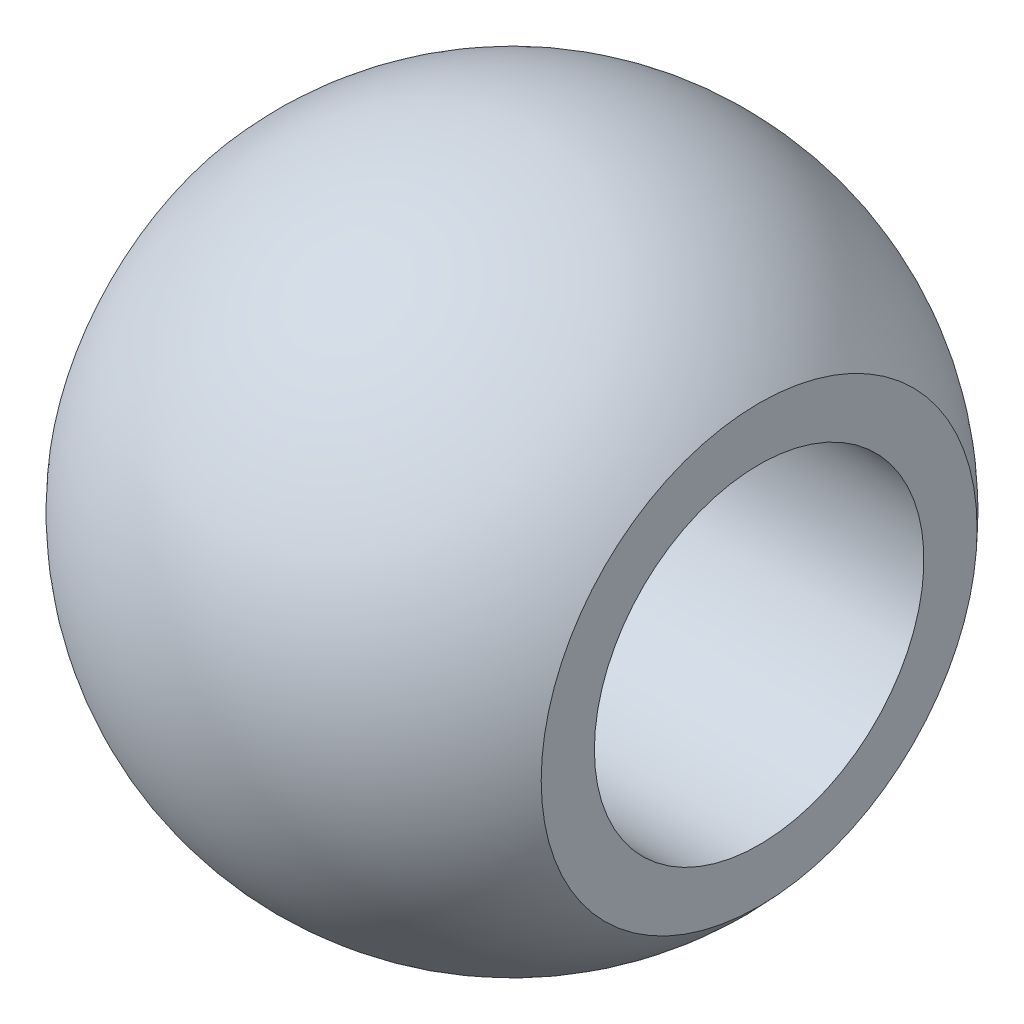
ISO-10303-21;
HEADER;
FILE_DESCRIPTION(('STEP AP214'),'2;1');
FILE_NAME('part.step','',(''),(''),'','','');
FILE_SCHEMA(('AUTOMOTIVE_DESIGN { 1 0 10303 214 1 1 1 1 }'));
ENDSEC;
DATA;
#1=APPLICATION_CONTEXT('core data for automotive mechanical design processes');
#2=APPLICATION_PROTOCOL_DEFINITION('international standard','automotive_design',2000,#1);
#3=PRODUCT_CONTEXT('',#1,'mechanical');
#4=PRODUCT('Part','Part','',(#3));
#5=PRODUCT_RELATED_PRODUCT_CATEGORY('part','',(#4));
#6=PRODUCT_DEFINITION_FORMATION('','',#4);
#7=PRODUCT_DEFINITION_CONTEXT('part definition',#1,'design');
#8=PRODUCT_DEFINITION('design','',#6,#7);
#9=PRODUCT_DEFINITION_SHAPE('','',#8);
#10=(LENGTH_UNIT() NAMED_UNIT(*) SI_UNIT(.MILLI.,.METRE.));
#11=(NAMED_UNIT(*) PLANE_ANGLE_UNIT() SI_UNIT($,.RADIAN.));
#12=(NAMED_UNIT(*) SI_UNIT($,.STERADIAN.) SOLID_ANGLE_UNIT());
#13=UNCERTAINTY_MEASURE_WITH_UNIT(LENGTH_MEASURE(1.E-05),#10,'distance_accuracy_value','');
#14=(GEOMETRIC_REPRESENTATION_CONTEXT(3) GLOBAL_UNCERTAINTY_ASSIGNED_CONTEXT((#13)) GLOBAL_UNIT_ASSIGNED_CONTEXT((#10,
#11,#12)) REPRESENTATION_CONTEXT('',''));
#15=CARTESIAN_POINT('',(0.,0.,0.));
#16=DIRECTION('',(0.,0.,1.));
#17=DIRECTION('',(1.,0.,0.));
#18=AXIS2_PLACEMENT_3D('',#15,#16,#17);
#19=CARTESIAN_POINT('',(-7.5,0.,0.));
#20=DIRECTION('',(1.,0.,0.));
#21=DIRECTION('',(0.,0.,-1.));
#22=AXIS2_PLACEMENT_3D('',#19,#20,#21);
#23=PLANE('',#22);
#24=CARTESIAN_POINT('',(-7.5,0.,0.));
#25=DIRECTION('',(1.,0.,0.));
#26=DIRECTION('',(0.,0.,-1.));
#27=AXIS2_PLACEMENT_3D('',#24,#25,#26);
#28=CIRCLE('',#27,5.);
#29=CARTESIAN_POINT('',(-7.5,0.,-5.));
#30=VERTEX_POINT('',#29);
#31=EDGE_CURVE('E51',#30,#30,#28,.T.);
#32=ORIENTED_EDGE('',*,*,#31,.T.);
#33=EDGE_LOOP('',(#32));
#34=FACE_BOUND('',#33,.T.);
#35=CARTESIAN_POINT('',(-7.5,0.,0.));
#36=DIRECTION('',(-1.,0.,0.));
#37=DIRECTION('',(0.,0.,1.));
#38=AXIS2_PLACEMENT_3D('',#35,#36,#37);
#39=CIRCLE('',#38,6.61437827766148);
#40=CARTESIAN_POINT('',(-7.5,0.,6.61437827766148));
#41=VERTEX_POINT('',#40);
#42=EDGE_CURVE('E46',#41,#41,#39,.T.);
#43=ORIENTED_EDGE('',*,*,#42,.T.);
#44=EDGE_LOOP('',(#43));
#45=FACE_BOUND('',#44,.T.);
#46=ADVANCED_FACE('F39',(#34,#45),#23,.F.);
#47=CARTESIAN_POINT('',(7.5,0.,0.));
#48=DIRECTION('',(-1.,0.,0.));
#49=DIRECTION('',(0.,0.,1.));
#50=AXIS2_PLACEMENT_3D('',#47,#48,#49);
#51=PLANE('',#50);
#52=CARTESIAN_POINT('',(7.5,0.,0.));
#53=DIRECTION('',(-1.,0.,0.));
#54=DIRECTION('',(0.,0.,1.));
#55=AXIS2_PLACEMENT_3D('',#52,#53,#54);
#56=CIRCLE('',#55,5.);
#57=CARTESIAN_POINT('',(7.5,0.,5.));
#58=VERTEX_POINT('',#57);
#59=EDGE_CURVE('E56',#58,#58,#56,.T.);
#60=ORIENTED_EDGE('',*,*,#59,.T.);
#61=EDGE_LOOP('',(#60));
#62=FACE_BOUND('',#61,.T.);
#63=CARTESIAN_POINT('',(7.5,0.,0.));
#64=DIRECTION('',(-1.,0.,0.));
#65=DIRECTION('',(0.,0.,1.));
#66=AXIS2_PLACEMENT_3D('',#63,#64,#65);
#67=CIRCLE('',#66,6.61437827766149);
#68=CARTESIAN_POINT('',(7.5,0.,6.61437827766149));
#69=VERTEX_POINT('',#68);
#70=EDGE_CURVE('E10',#69,#69,#67,.T.);
#71=ORIENTED_EDGE('',*,*,#70,.F.);
#72=EDGE_LOOP('',(#71));
#73=FACE_BOUND('',#72,.T.);
#74=ADVANCED_FACE('F63',(#62,#73),#51,.F.);
#75=CARTESIAN_POINT('',(0.,0.,0.));
#76=DIRECTION('',(-1.,0.,0.));
#77=DIRECTION('',(0.,1.,0.));
#78=AXIS2_PLACEMENT_3D('',#75,#76,#77);
#79=SPHERICAL_SURFACE('',#78,10.);
#80=ORIENTED_EDGE('',*,*,#42,.F.);
#81=EDGE_LOOP('',(#80));
#82=FACE_BOUND('',#81,.T.);
#83=ORIENTED_EDGE('',*,*,#70,.T.);
#84=EDGE_LOOP('',(#83));
#85=FACE_BOUND('',#84,.T.);
#86=ADVANCED_FACE('F69',(#82,#85),#79,.T.);
#87=CARTESIAN_POINT('',(7.5,0.,0.));
#88=DIRECTION('',(-1.,0.,0.));
#89=DIRECTION('',(0.,0.,1.));
#90=AXIS2_PLACEMENT_3D('',#87,#88,#89);
#91=CYLINDRICAL_SURFACE('',#90,5.);
#92=ORIENTED_EDGE('',*,*,#59,.F.);
#93=EDGE_LOOP('',(#92));
#94=FACE_BOUND('',#93,.T.);
#95=ORIENTED_EDGE('',*,*,#31,.F.);
#96=EDGE_LOOP('',(#95));
#97=FACE_BOUND('',#96,.T.);
#98=ADVANCED_FACE('F66',(#94,#97),#91,.F.);
#99=CLOSED_SHELL('',(#46,#74,#86,#98));
#100=MANIFOLD_SOLID_BREP('B2',#99);
#101=ADVANCED_BREP_SHAPE_REPRESENTATION('',(#18,#100),#14);
#102=SHAPE_DEFINITION_REPRESENTATION(#9,#101);
ENDSEC;
END-ISO-10303-21;
